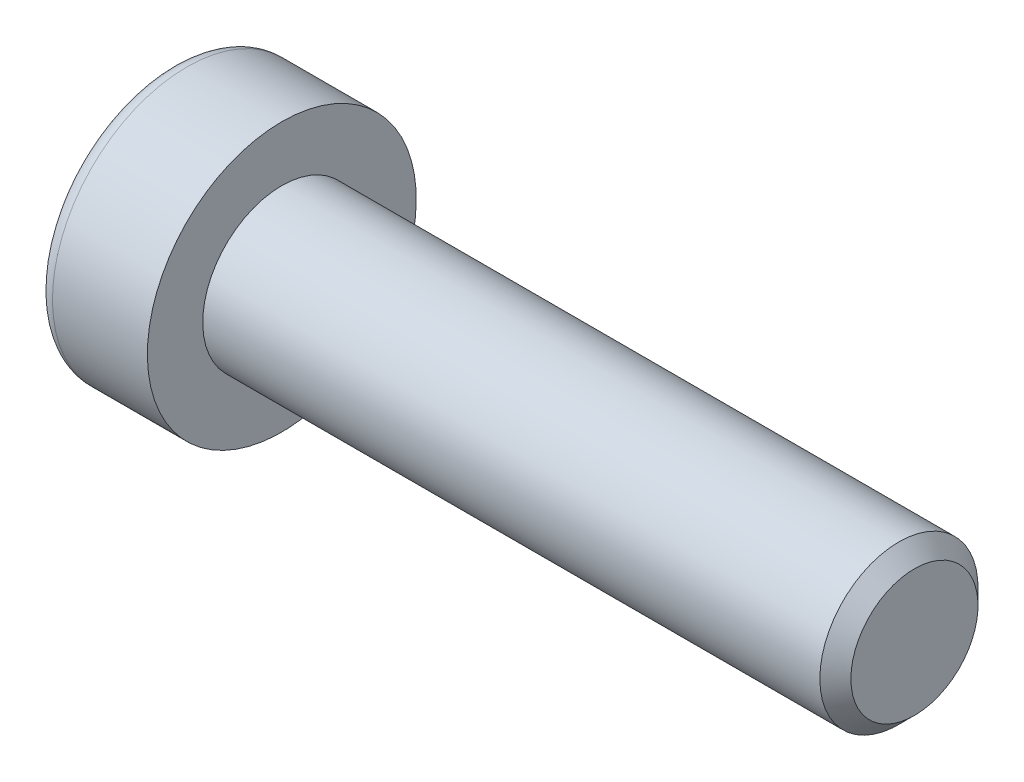
ISO-10303-21;
HEADER;
FILE_DESCRIPTION(('STEP AP214'),'2;1');
FILE_NAME('part.step','',(''),(''),'','','');
FILE_SCHEMA(('AUTOMOTIVE_DESIGN { 1 0 10303 214 1 1 1 1 }'));
ENDSEC;
DATA;
#1=APPLICATION_CONTEXT('core data for automotive mechanical design processes');
#2=APPLICATION_PROTOCOL_DEFINITION('international standard','automotive_design',2000,#1);
#3=PRODUCT_CONTEXT('',#1,'mechanical');
#4=PRODUCT('Part','Part','',(#3));
#5=PRODUCT_RELATED_PRODUCT_CATEGORY('part','',(#4));
#6=PRODUCT_DEFINITION_FORMATION('','',#4);
#7=PRODUCT_DEFINITION_CONTEXT('part definition',#1,'design');
#8=PRODUCT_DEFINITION('design','',#6,#7);
#9=PRODUCT_DEFINITION_SHAPE('','',#8);
#10=(LENGTH_UNIT() NAMED_UNIT(*) SI_UNIT(.MILLI.,.METRE.));
#11=(NAMED_UNIT(*) PLANE_ANGLE_UNIT() SI_UNIT($,.RADIAN.));
#12=(NAMED_UNIT(*) SI_UNIT($,.STERADIAN.) SOLID_ANGLE_UNIT());
#13=UNCERTAINTY_MEASURE_WITH_UNIT(LENGTH_MEASURE(1.E-05),#10,'distance_accuracy_value','');
#14=(GEOMETRIC_REPRESENTATION_CONTEXT(3) GLOBAL_UNCERTAINTY_ASSIGNED_CONTEXT((#13)) GLOBAL_UNIT_ASSIGNED_CONTEXT((#10,
#11,#12)) REPRESENTATION_CONTEXT('',''));
#15=CARTESIAN_POINT('',(0.,0.,0.));
#16=DIRECTION('',(0.,0.,1.));
#17=DIRECTION('',(1.,0.,0.));
#18=AXIS2_PLACEMENT_3D('',#15,#16,#17);
#19=CARTESIAN_POINT('',(-3.5,-1.5,0.866025403784439));
#20=DIRECTION('',(0.,-0.5,0.866025403784439));
#21=DIRECTION('',(0.,-0.866025403784439,-0.5));
#22=AXIS2_PLACEMENT_3D('',#19,#20,#21);
#23=PLANE('',#22);
#24=DIRECTION('',(1.,0.,0.));
#25=VECTOR('',#24,1.);
#26=CARTESIAN_POINT('',(-3.5,-1.5,0.866025403784438));
#27=LINE('',#26,#25);
#28=CARTESIAN_POINT('',(-0.799999988867068,-1.49999996233255,0.866025425531749));
#29=VERTEX_POINT('',#28);
#30=CARTESIAN_POINT('',(-3.5,-1.5,0.866025403784438));
#31=VERTEX_POINT('',#30);
#32=EDGE_CURVE('E77',#29,#31,#27,.F.);
#33=ORIENTED_EDGE('',*,*,#32,.T.);
#34=DIRECTION('',(0.,-0.866025403784439,-0.5));
#35=VECTOR('',#34,1.);
#36=CARTESIAN_POINT('',(-3.5,-1.5,0.866025403784439));
#37=LINE('',#36,#35);
#38=CARTESIAN_POINT('',(-3.5,0.,1.73205080756888));
#39=VERTEX_POINT('',#38);
#40=EDGE_CURVE('E89',#39,#31,#37,.T.);
#41=ORIENTED_EDGE('',*,*,#40,.F.);
#42=DIRECTION('',(1.,0.,0.));
#43=VECTOR('',#42,1.);
#44=CARTESIAN_POINT('',(-3.5,0.,1.73205080756888));
#45=LINE('',#44,#43);
#46=CARTESIAN_POINT('',(-0.799999997521485,1.17041970314799E-08,1.73205080081146));
#47=VERTEX_POINT('',#46);
#48=EDGE_CURVE('E72',#39,#47,#45,.T.);
#49=ORIENTED_EDGE('',*,*,#48,.T.);
#50=CARTESIAN_POINT('',(-0.800000004794053,-1.69571014172341E-08,1.73205077642877));
#51=CARTESIAN_POINT('',(-0.778021656696874,-0.0659159374438855,1.69399421567383));
#52=CARTESIAN_POINT('',(-0.758033503093598,-0.132400840652987,1.65560914452181));
#53=CARTESIAN_POINT('',(-0.723144784654454,-0.266521786306955,1.57817438455973));
#54=CARTESIAN_POINT('',(-0.708256560777632,-0.334160211038563,1.53912332031867));
#55=CARTESIAN_POINT('',(-0.685081966752258,-0.468598851907672,1.46150513374616));
#56=CARTESIAN_POINT('',(-0.67664133885179,-0.535378388716331,1.42294995058342));
#57=CARTESIAN_POINT('',(-0.666566875869104,-0.669251518013702,1.34565826362971));
#58=CARTESIAN_POINT('',(-0.664924696262234,-0.736344624244432,1.30692204058053));
#59=CARTESIAN_POINT('',(-0.668349720014557,-0.861700886716701,1.23454756863114));
#60=CARTESIAN_POINT('',(-0.672575966117477,-0.919982853711116,1.20089845932059));
#61=CARTESIAN_POINT('',(-0.685967975897171,-1.03616709970217,1.13381945363874));
#62=CARTESIAN_POINT('',(-0.695138309776003,-1.09406897714887,1.10038978910236));
#63=CARTESIAN_POINT('',(-0.718062369113586,-1.2104925736284,1.03317259433002));
#64=CARTESIAN_POINT('',(-0.731913222805025,-1.26899956512162,0.999393567043165));
#65=CARTESIAN_POINT('',(-0.763348804941712,-1.38514116892087,0.932339180828007));
#66=CARTESIAN_POINT('',(-0.780926152022884,-1.44277726798599,0.89906296351894));
#67=CARTESIAN_POINT('',(-0.799999976323267,-1.49999992470115,0.866025447258253));
#68=B_SPLINE_CURVE_WITH_KNOTS('',3,(#50,#51,#52,#53,#54,#55,#56,#57,#58,#59,#60,#61,#62,#63,#64,
#65,#66,#67),.UNSPECIFIED.,.F.,.F.,(4,2,2,2,2,2,2,2,4),(0.,0.237762010114539,0.476095365250291,
0.708530707823554,0.940680670783404,1.14278081101932,1.3450680891288,1.55184112920544,
1.75820836138337),.UNSPECIFIED.);
#69=EDGE_CURVE('E18',#47,#29,#68,.T.);
#70=ORIENTED_EDGE('',*,*,#69,.T.);
#71=EDGE_LOOP('',(#33,#41,#49,#70));
#72=FACE_BOUND('',#71,.T.);
#73=ADVANCED_FACE('F14',(#72),#23,.F.);
#74=CARTESIAN_POINT('',(-3.5,-1.5,-0.866025403784438));
#75=DIRECTION('',(0.,-1.,0.));
#76=DIRECTION('',(0.,0.,-1.));
#77=AXIS2_PLACEMENT_3D('',#74,#75,#76);
#78=PLANE('',#77);
#79=DIRECTION('',(1.,0.,0.));
#80=VECTOR('',#79,1.);
#81=CARTESIAN_POINT('',(-3.5,-1.5,-0.866025403784439));
#82=LINE('',#81,#80);
#83=CARTESIAN_POINT('',(-0.799999988871031,-1.5,-0.866025360303542));
#84=VERTEX_POINT('',#83);
#85=CARTESIAN_POINT('',(-3.5,-1.5,-0.866025403784438));
#86=VERTEX_POINT('',#85);
#87=EDGE_CURVE('E215',#84,#86,#82,.F.);
#88=ORIENTED_EDGE('',*,*,#87,.T.);
#89=DIRECTION('',(0.,0.,-1.));
#90=VECTOR('',#89,1.);
#91=CARTESIAN_POINT('',(-3.5,-1.5,-0.866025403784438));
#92=LINE('',#91,#90);
#93=EDGE_CURVE('E88',#31,#86,#92,.T.);
#94=ORIENTED_EDGE('',*,*,#93,.F.);
#95=ORIENTED_EDGE('',*,*,#32,.F.);
#96=CARTESIAN_POINT('',(-0.800000033434989,-1.49999996275919,0.866025430217359));
#97=CARTESIAN_POINT('',(-0.778021676301525,-1.49999998662477,0.789912288030923));
#98=CARTESIAN_POINT('',(-0.758033517947388,-1.49999999641521,0.71314213601303));
#99=CARTESIAN_POINT('',(-0.723144793881313,-1.5000000035934,0.558272606337249));
#100=CARTESIAN_POINT('',(-0.708256569131695,-1.50000000095129,0.480170477841771));
#101=CARTESIAN_POINT('',(-0.68508197255406,-1.49999999907226,0.324934102206935));
#102=CARTESIAN_POINT('',(-0.676641342974203,-1.49999999975269,0.247823733476011));
#103=CARTESIAN_POINT('',(-0.666566877161477,-1.500000000247,0.0932403552687408));
#104=CARTESIAN_POINT('',(-0.664924696406791,-1.50000000006194,0.01576790727506));
#105=CARTESIAN_POINT('',(-0.668349718342616,-1.49999999994608,-0.12898104146176));
#106=CARTESIAN_POINT('',(-0.672575963817816,-1.49999999998547,-0.196279262989629));
#107=CARTESIAN_POINT('',(-0.685967972836551,-1.50000000001455,-0.330437280109427));
#108=CARTESIAN_POINT('',(-0.695138306581063,-1.5000000000042,-0.397296612031607));
#109=CARTESIAN_POINT('',(-0.718062366109409,-1.49999999999571,-0.531731007513679));
#110=CARTESIAN_POINT('',(-0.731913220149705,-1.49999999999786,-0.599289065171955));
#111=CARTESIAN_POINT('',(-0.763348803360585,-1.50000000000214,-0.733397843717908));
#112=CARTESIAN_POINT('',(-0.780926151167941,-1.50000000000427,-0.799950281366898));
#113=CARTESIAN_POINT('',(-0.799999976331814,-1.5,-0.866025316866421));
#114=B_SPLINE_CURVE_WITH_KNOTS('',3,(#96,#97,#98,#99,#100,#101,#102,#103,#104,#105,#106,#107,
#108,#109,#110,#111,#112,#113),.UNSPECIFIED.,.F.,.F.,(4,2,2,2,2,2,2,2,4),(0.,0.237762017439527,
0.476095379639777,0.708530728272866,0.940680697404313,1.14278084610673,1.34506813262744,
1.55184118195675,1.75820842345583),.UNSPECIFIED.);
#115=EDGE_CURVE('E82',#29,#84,#114,.T.);
#116=ORIENTED_EDGE('',*,*,#115,.T.);
#117=EDGE_LOOP('',(#88,#94,#95,#116));
#118=FACE_BOUND('',#117,.T.);
#119=ADVANCED_FACE('F86',(#118),#78,.F.);
#120=CARTESIAN_POINT('',(-3.5,0.,1.73205080756888));
#121=DIRECTION('',(0.,0.500000000000001,0.866025403784438));
#122=DIRECTION('',(0.,-0.866025403784438,0.500000000000001));
#123=AXIS2_PLACEMENT_3D('',#120,#121,#122);
#124=PLANE('',#123);
#125=ORIENTED_EDGE('',*,*,#48,.F.);
#126=DIRECTION('',(0.,-0.866025403784438,0.500000000000001));
#127=VECTOR('',#126,1.);
#128=CARTESIAN_POINT('',(-3.5,0.,1.73205080756888));
#129=LINE('',#128,#127);
#130=CARTESIAN_POINT('',(-3.5,1.5,0.866025403784437));
#131=VERTEX_POINT('',#130);
#132=EDGE_CURVE('E218',#131,#39,#129,.T.);
#133=ORIENTED_EDGE('',*,*,#132,.F.);
#134=DIRECTION('',(1.,0.,0.));
#135=VECTOR('',#134,1.);
#136=CARTESIAN_POINT('',(-3.5,1.5,0.866025403784437));
#137=LINE('',#136,#135);
#138=CARTESIAN_POINT('',(-0.799999988867498,1.5,0.866025360291303));
#139=VERTEX_POINT('',#138);
#140=EDGE_CURVE('E83',#131,#139,#137,.T.);
#141=ORIENTED_EDGE('',*,*,#140,.T.);
#142=CARTESIAN_POINT('',(-0.800000033433567,1.50000000426921,0.8660253583187));
#143=CARTESIAN_POINT('',(-0.778021676295276,1.43408410149037,0.904081950088849));
#144=CARTESIAN_POINT('',(-0.758033517936987,1.36759920446941,0.942467034585691));
#145=CARTESIAN_POINT('',(-0.723144793864638,1.23347826105221,1.01990180566003));
#146=CARTESIAN_POINT('',(-0.708256569113062,1.16583983234576,1.05895286763048));
#147=CARTESIAN_POINT('',(-0.68508197254175,1.03140118651243,1.13657105382219));
#148=CARTESIAN_POINT('',(-0.676641342966919,0.96462164865295,1.1751262387674));
#149=CARTESIAN_POINT('',(-0.666566877160271,0.830748516405722,1.25241792827836));
#150=CARTESIAN_POINT('',(-0.664924696406481,0.763655408276764,1.29115415210369));
#151=CARTESIAN_POINT('',(-0.668349718457172,0.638299137294113,1.36352862876635));
#152=CARTESIAN_POINT('',(-0.67257596442367,0.580017163683088,1.39717774196506));
#153=CARTESIAN_POINT('',(-0.68596797510084,0.463832904503485,1.46425675531158));
#154=CARTESIAN_POINT('',(-0.695138310014093,0.40593102048483,1.49768642362438));
#155=CARTESIAN_POINT('',(-0.718062372456597,0.289507410578443,1.56490362613407));
#156=CARTESIAN_POINT('',(-0.73191322826342,0.231000412237723,1.59868265737804));
#157=CARTESIAN_POINT('',(-0.763348815391527,0.114858794941851,1.66573705139287));
#158=CARTESIAN_POINT('',(-0.780926165347246,0.0572226892272379,1.69901327254471));
#159=CARTESIAN_POINT('',(-0.799999992771162,2.59551646262387E-08,1.73205079258366));
#160=B_SPLINE_CURVE_WITH_KNOTS('',3,(#142,#143,#144,#145,#146,#147,#148,#149,#150,#151,#152,
#153,#154,#155,#156,#157,#158,#159),.UNSPECIFIED.,.F.,.F.,(4,2,2,2,2,2,2,2,4),(0.,
0.237762017496781,0.476095379761698,0.708530728335868,0.94068069740302,1.14278086052986,
1.34506816152837,1.55184122608726,1.75820848269998),.UNSPECIFIED.);
#161=EDGE_CURVE('E119',#139,#47,#160,.T.);
#162=ORIENTED_EDGE('',*,*,#161,.T.);
#163=EDGE_LOOP('',(#125,#133,#141,#162));
#164=FACE_BOUND('',#163,.T.);
#165=ADVANCED_FACE('F112',(#164),#124,.F.);
#166=CARTESIAN_POINT('',(-3.5,0.,-1.73205080756888));
#167=DIRECTION('',(0.,-0.5,-0.866025403784439));
#168=DIRECTION('',(0.,0.866025403784439,-0.5));
#169=AXIS2_PLACEMENT_3D('',#166,#167,#168);
#170=PLANE('',#169);
#171=DIRECTION('',(1.,0.,0.));
#172=VECTOR('',#171,1.);
#173=CARTESIAN_POINT('',(-3.5,0.,-1.73205080756888));
#174=LINE('',#173,#172);
#175=CARTESIAN_POINT('',(-0.799999993625576,-5.19317473647624E-08,-1.73205079406354));
#176=VERTEX_POINT('',#175);
#177=CARTESIAN_POINT('',(-3.5,0.,-1.73205080756888));
#178=VERTEX_POINT('',#177);
#179=EDGE_CURVE('E124',#176,#178,#174,.F.);
#180=ORIENTED_EDGE('',*,*,#179,.T.);
#181=DIRECTION('',(0.,0.866025403784439,-0.5));
#182=VECTOR('',#181,1.);
#183=CARTESIAN_POINT('',(-3.5,0.,-1.73205080756888));
#184=LINE('',#183,#182);
#185=EDGE_CURVE('E37',#86,#178,#184,.T.);
#186=ORIENTED_EDGE('',*,*,#185,.F.);
#187=ORIENTED_EDGE('',*,*,#87,.F.);
#188=CARTESIAN_POINT('',(-0.800000033429313,-1.5000000042963,-0.866025358321739));
#189=CARTESIAN_POINT('',(-0.778021676302421,-1.43408410152741,-0.904081950074176));
#190=CARTESIAN_POINT('',(-0.75803351795084,-1.3675992045205,-0.942467034557997));
#191=CARTESIAN_POINT('',(-0.723144793886204,-1.23347826113726,-1.01990180560912));
#192=CARTESIAN_POINT('',(-0.708256569135469,-1.16583983245078,-1.05895286756938));
#193=CARTESIAN_POINT('',(-0.685081972556364,-1.03140118662151,-1.13657105375968));
#194=CARTESIAN_POINT('',(-0.676641342976148,-0.964621648745721,-1.17512623871396));
#195=CARTESIAN_POINT('',(-0.666566877162353,-0.830748516463139,-1.25241792824509));
#196=CARTESIAN_POINT('',(-0.664924696406954,-0.763655408315126,-1.29115415208152));
#197=CARTESIAN_POINT('',(-0.668349718341486,-0.638299141479767,-1.36352862634979));
#198=CARTESIAN_POINT('',(-0.672575963816185,-0.580017172026168,-1.39717773714819));
#199=CARTESIAN_POINT('',(-0.685967972834059,-0.463832921092294,-1.46425674573402));
#200=CARTESIAN_POINT('',(-0.695138306578215,-0.405931041161778,-1.49768641168654));
#201=CARTESIAN_POINT('',(-0.718062366105987,-0.289507439526365,-1.56490360942098));
#202=CARTESIAN_POINT('',(-0.731913220146064,-0.23100044536442,-1.59868263825233));
#203=CARTESIAN_POINT('',(-0.763348803356627,-0.114858836274076,-1.6657370275297));
#204=CARTESIAN_POINT('',(-0.780926151163884,-0.0572227345867656,-1.69901324635637));
#205=CARTESIAN_POINT('',(-0.799999976327709,-7.52855253321485E-08,-1.73205076410276));
#206=B_SPLINE_CURVE_WITH_KNOTS('',3,(#188,#189,#190,#191,#192,#193,#194,#195,#196,#197,#198,
#199,#200,#201,#202,#203,#204,#205),.UNSPECIFIED.,.F.,.F.,(4,2,2,2,2,2,2,2,4),(0.,
0.237762017437609,0.476095379636302,0.708530728268337,0.940680697398584,1.14278084610309,
1.34506813262598,1.55184118195724,1.75820842345815),.UNSPECIFIED.);
#207=EDGE_CURVE('E95',#84,#176,#206,.T.);
#208=ORIENTED_EDGE('',*,*,#207,.T.);
#209=EDGE_LOOP('',(#180,#186,#187,#208));
#210=FACE_BOUND('',#209,.T.);
#211=ADVANCED_FACE('F115',(#210),#170,.F.);
#212=CARTESIAN_POINT('',(-3.5,1.5,0.866025403784437));
#213=DIRECTION('',(0.,1.,0.));
#214=DIRECTION('',(0.,0.,1.));
#215=AXIS2_PLACEMENT_3D('',#212,#213,#214);
#216=PLANE('',#215);
#217=ORIENTED_EDGE('',*,*,#140,.F.);
#218=DIRECTION('',(0.,0.,1.));
#219=VECTOR('',#218,1.);
#220=CARTESIAN_POINT('',(-3.5,1.5,0.866025403784437));
#221=LINE('',#220,#219);
#222=CARTESIAN_POINT('',(-3.5,1.5,-0.866025403784439));
#223=VERTEX_POINT('',#222);
#224=EDGE_CURVE('E211',#223,#131,#221,.T.);
#225=ORIENTED_EDGE('',*,*,#224,.F.);
#226=DIRECTION('',(1.,0.,0.));
#227=VECTOR('',#226,1.);
#228=CARTESIAN_POINT('',(-3.5,1.5,-0.866025403784439));
#229=LINE('',#228,#227);
#230=CARTESIAN_POINT('',(-0.800000001368559,1.5,-0.866025403596251));
#231=VERTEX_POINT('',#230);
#232=EDGE_CURVE('E202',#223,#231,#229,.T.);
#233=ORIENTED_EDGE('',*,*,#232,.T.);
#234=CARTESIAN_POINT('',(-0.800000001154136,1.50000000026491,-0.866025403454279));
#235=CARTESIAN_POINT('',(-0.778021660048943,1.50000000009515,-0.789912260141364));
#236=CARTESIAN_POINT('',(-0.758033509022436,1.5000000000255,-0.713142109270289));
#237=CARTESIAN_POINT('',(-0.723144791693316,1.49999999997444,-0.558272583727159));
#238=CARTESIAN_POINT('',(-0.708256566349069,1.49999999999323,-0.480170458219125));
#239=CARTESIAN_POINT('',(-0.685081970234259,1.5000000000066,-0.324934087631714));
#240=CARTESIAN_POINT('',(-0.676641341702514,1.50000000000176,-0.247823720966487));
#241=CARTESIAN_POINT('',(-0.666566877089259,1.49999999999824,-0.0932403471747105));
#242=CARTESIAN_POINT('',(-0.664924696478615,1.49999999999956,-0.015767901531159));
#243=CARTESIAN_POINT('',(-0.668349718474959,1.50000000000038,0.128981044687817));
#244=CARTESIAN_POINT('',(-0.672575964042955,1.5000000000001,0.196279266039076));
#245=CARTESIAN_POINT('',(-0.685967973189808,1.4999999999999,0.330437282853159));
#246=CARTESIAN_POINT('',(-0.695138306973846,1.49999999999997,0.397296614645791));
#247=CARTESIAN_POINT('',(-0.71806236652139,1.50000000000003,0.531731009611409));
#248=CARTESIAN_POINT('',(-0.731913220523855,1.50000000000002,0.599289066885838));
#249=CARTESIAN_POINT('',(-0.763348803593243,1.49999999999999,0.733397844592943));
#250=CARTESIAN_POINT('',(-0.780926151292484,1.49999999999997,0.799950281787972));
#251=CARTESIAN_POINT('',(-0.799999976324083,1.5,0.866025316839637));
#252=B_SPLINE_CURVE_WITH_KNOTS('',3,(#234,#235,#236,#237,#238,#239,#240,#241,#242,#243,#244,
#245,#246,#247,#248,#249,#250,#251),.UNSPECIFIED.,.F.,.F.,(4,2,2,2,2,2,2,2,4),(0.,
0.237762008631603,0.476095362696117,0.708530704661828,0.940680666845777,1.14278081501453,
1.34506810117545,1.5518411493544,1.75820838945523),.UNSPECIFIED.);
#253=EDGE_CURVE('E96',#231,#139,#252,.T.);
#254=ORIENTED_EDGE('',*,*,#253,.T.);
#255=EDGE_LOOP('',(#217,#225,#233,#254));
#256=FACE_BOUND('',#255,.T.);
#257=ADVANCED_FACE('F134',(#256),#216,.F.);
#258=CARTESIAN_POINT('',(-0.80600000103459,0.,0.));
#259=DIRECTION('',(-1.,0.,0.));
#260=DIRECTION('',(0.,0.,1.));
#261=AXIS2_PLACEMENT_3D('',#258,#259,#260);
#262=CONICAL_SURFACE('',#261,1.74244311170924,1.04719754984197);
#263=CARTESIAN_POINT('',(0.200000001427725,-1.13686837721616E-10,0.));
#264=VERTEX_POINT('',#263);
#265=VERTEX_LOOP('',#264);
#266=FACE_BOUND('',#265,.T.);
#267=ORIENTED_EDGE('',*,*,#253,.F.);
#268=CARTESIAN_POINT('',(-0.800000001154134,1.49999999984653,-0.866025404178943));
#269=CARTESIAN_POINT('',(-0.778021660038383,1.4340840840587,-0.904081975706894));
#270=CARTESIAN_POINT('',(-0.758033509003093,1.36759918308469,-0.942467051100864));
#271=CARTESIAN_POINT('',(-0.723144791660858,1.23347823959674,-1.01990181386864));
#272=CARTESIAN_POINT('',(-0.708256566312607,1.165839814789,-1.05895287666065));
#273=CARTESIAN_POINT('',(-0.685081970210198,1.03140117427002,-1.1365710619692));
#274=CARTESIAN_POINT('',(-0.676641341688346,0.964621637873208,-1.17512624527867));
#275=CARTESIAN_POINT('',(-0.666566877086974,0.83074850923666,-1.25241793213018));
#276=CARTESIAN_POINT('',(-0.664924696478011,0.763655403255479,-1.29115415493071));
#277=CARTESIAN_POINT('',(-0.668349718704072,0.638299130357656,-1.36352863283382));
#278=CARTESIAN_POINT('',(-0.672575965255319,0.580017152715343,-1.39717774831419));
#279=CARTESIAN_POINT('',(-0.685967977721396,0.463832885526248,-1.46425676625118));
#280=CARTESIAN_POINT('',(-0.695138313844609,0.405930997529957,-1.49768643687251));
#281=CARTESIAN_POINT('',(-0.718062379224753,0.289507379790228,-1.56490364391464));
#282=CARTESIAN_POINT('',(-0.731913236762889,0.23100037759508,-1.59868267738147));
#283=CARTESIAN_POINT('',(-0.763348827672567,0.114858752804272,-1.66573707571853));
#284=CARTESIAN_POINT('',(-0.780926179671749,0.0572226434477013,-1.69901329897057));
#285=CARTESIAN_POINT('',(-0.800000009226824,-2.34118217365936E-08,-1.7320508210857));
#286=B_SPLINE_CURVE_WITH_KNOTS('',3,(#268,#269,#270,#271,#272,#273,#274,#275,#276,#277,#278,
#279,#280,#281,#282,#283,#284,#285),.UNSPECIFIED.,.F.,.F.,(4,2,2,2,2,2,2,2,4),(0.,
0.237762008746921,0.476095362941565,0.708530704789954,0.940680666845832,1.14278084388537,
1.34506815902389,1.55184123768522,1.75820850803633),.UNSPECIFIED.);
#287=EDGE_CURVE('E125',#231,#176,#286,.T.);
#288=ORIENTED_EDGE('',*,*,#287,.T.);
#289=ORIENTED_EDGE('',*,*,#207,.F.);
#290=ORIENTED_EDGE('',*,*,#115,.F.);
#291=ORIENTED_EDGE('',*,*,#69,.F.);
#292=ORIENTED_EDGE('',*,*,#161,.F.);
#293=EDGE_LOOP('',(#267,#288,#289,#290,#291,#292));
#294=FACE_BOUND('',#293,.T.);
#295=ADVANCED_FACE('F93',(#266,#294),#262,.F.);
#296=CARTESIAN_POINT('',(-3.5,1.5,-0.866025403784439));
#297=DIRECTION('',(0.,0.5,-0.866025403784439));
#298=DIRECTION('',(0.,0.866025403784439,0.5));
#299=AXIS2_PLACEMENT_3D('',#296,#297,#298);
#300=PLANE('',#299);
#301=ORIENTED_EDGE('',*,*,#232,.F.);
#302=DIRECTION('',(0.,0.866025403784439,0.5));
#303=VECTOR('',#302,1.);
#304=CARTESIAN_POINT('',(-3.5,0.,-1.73205080756888));
#305=LINE('',#304,#303);
#306=EDGE_CURVE('E213',#178,#223,#305,.T.);
#307=ORIENTED_EDGE('',*,*,#306,.F.);
#308=ORIENTED_EDGE('',*,*,#179,.F.);
#309=ORIENTED_EDGE('',*,*,#287,.F.);
#310=EDGE_LOOP('',(#301,#307,#308,#309));
#311=FACE_BOUND('',#310,.T.);
#312=ADVANCED_FACE('F143',(#311),#300,.F.);
#313=CARTESIAN_POINT('',(-3.5,2.99102540378444,0.));
#314=DIRECTION('',(-1.,0.,0.));
#315=DIRECTION('',(0.,0.,1.));
#316=AXIS2_PLACEMENT_3D('',#313,#314,#315);
#317=PLANE('',#316);
#318=ORIENTED_EDGE('',*,*,#185,.T.);
#319=ORIENTED_EDGE('',*,*,#306,.T.);
#320=ORIENTED_EDGE('',*,*,#224,.T.);
#321=ORIENTED_EDGE('',*,*,#132,.T.);
#322=ORIENTED_EDGE('',*,*,#40,.T.);
#323=ORIENTED_EDGE('',*,*,#93,.T.);
#324=EDGE_LOOP('',(#318,#319,#320,#321,#322,#323));
#325=FACE_BOUND('',#324,.T.);
#326=CARTESIAN_POINT('',(-3.5,0.,0.));
#327=DIRECTION('',(1.,0.,0.));
#328=DIRECTION('',(0.,1.,0.));
#329=AXIS2_PLACEMENT_3D('',#326,#327,#328);
#330=CIRCLE('',#329,3.75);
#331=CARTESIAN_POINT('',(-3.5,3.75,0.));
#332=VERTEX_POINT('',#331);
#333=EDGE_CURVE('E189',#332,#332,#330,.T.);
#334=ORIENTED_EDGE('',*,*,#333,.F.);
#335=EDGE_LOOP('',(#334));
#336=FACE_BOUND('',#335,.T.);
#337=ADVANCED_FACE('F176',(#325,#336),#317,.T.);
#338=CARTESIAN_POINT('',(-3.,0.,0.));
#339=DIRECTION('',(1.,0.,0.));
#340=DIRECTION('',(0.,0.,-1.));
#341=AXIS2_PLACEMENT_3D('',#338,#339,#340);
#342=TOROIDAL_SURFACE('',#341,3.75,0.5);
#343=CARTESIAN_POINT('',(-3.,0.,0.));
#344=DIRECTION('',(1.,0.,0.));
#345=DIRECTION('',(0.,1.,0.));
#346=AXIS2_PLACEMENT_3D('',#343,#344,#345);
#347=CIRCLE('',#346,4.25);
#348=CARTESIAN_POINT('',(-3.,4.25,0.));
#349=VERTEX_POINT('',#348);
#350=EDGE_CURVE('E229',#349,#349,#347,.T.);
#351=ORIENTED_EDGE('',*,*,#350,.F.);
#352=EDGE_LOOP('',(#351));
#353=FACE_BOUND('',#352,.T.);
#354=ORIENTED_EDGE('',*,*,#333,.T.);
#355=EDGE_LOOP('',(#354));
#356=FACE_BOUND('',#355,.T.);
#357=ADVANCED_FACE('F170',(#353,#356),#342,.T.);
#358=CARTESIAN_POINT('',(-1.75,0.,0.));
#359=DIRECTION('',(1.,0.,0.));
#360=DIRECTION('',(0.,1.,0.));
#361=AXIS2_PLACEMENT_3D('',#358,#359,#360);
#362=CYLINDRICAL_SURFACE('',#361,4.25);
#363=ORIENTED_EDGE('',*,*,#350,.T.);
#364=EDGE_LOOP('',(#363));
#365=FACE_BOUND('',#364,.T.);
#366=CARTESIAN_POINT('',(0.,0.,0.));
#367=DIRECTION('',(1.,0.,0.));
#368=DIRECTION('',(0.,1.,0.));
#369=AXIS2_PLACEMENT_3D('',#366,#367,#368);
#370=CIRCLE('',#369,4.25);
#371=CARTESIAN_POINT('',(0.,4.25,0.));
#372=VERTEX_POINT('',#371);
#373=EDGE_CURVE('E227',#372,#372,#370,.T.);
#374=ORIENTED_EDGE('',*,*,#373,.F.);
#375=EDGE_LOOP('',(#374));
#376=FACE_BOUND('',#375,.T.);
#377=ADVANCED_FACE('F166',(#365,#376),#362,.T.);
#378=CARTESIAN_POINT('',(20.,1.25,0.));
#379=DIRECTION('',(1.,0.,0.));
#380=DIRECTION('',(0.,0.,-1.));
#381=AXIS2_PLACEMENT_3D('',#378,#379,#380);
#382=PLANE('',#381);
#383=CARTESIAN_POINT('',(20.0000000002092,0.,0.));
#384=DIRECTION('',(-1.,0.,0.));
#385=DIRECTION('',(0.,0.,1.));
#386=AXIS2_PLACEMENT_3D('',#383,#384,#385);
#387=CIRCLE('',#386,2.00924000017721);
#388=CARTESIAN_POINT('',(20.0000000002092,0.,2.00924000017721));
#389=VERTEX_POINT('',#388);
#390=EDGE_CURVE('E225',#389,#389,#387,.T.);
#391=ORIENTED_EDGE('',*,*,#390,.F.);
#392=EDGE_LOOP('',(#391));
#393=FACE_BOUND('',#392,.T.);
#394=ADVANCED_FACE('F162',(#393),#382,.T.);
#395=CARTESIAN_POINT('',(0.,3.375,0.));
#396=DIRECTION('',(1.,0.,0.));
#397=DIRECTION('',(0.,0.,-1.));
#398=AXIS2_PLACEMENT_3D('',#395,#396,#397);
#399=PLANE('',#398);
#400=CARTESIAN_POINT('',(0.,0.,0.));
#401=DIRECTION('',(1.,0.,0.));
#402=DIRECTION('',(0.,1.,0.));
#403=AXIS2_PLACEMENT_3D('',#400,#401,#402);
#404=CIRCLE('',#403,2.5);
#405=CARTESIAN_POINT('',(0.,2.5,0.));
#406=VERTEX_POINT('',#405);
#407=EDGE_CURVE('E28',#406,#406,#404,.T.);
#408=ORIENTED_EDGE('',*,*,#407,.F.);
#409=EDGE_LOOP('',(#408));
#410=FACE_BOUND('',#409,.T.);
#411=ORIENTED_EDGE('',*,*,#373,.T.);
#412=EDGE_LOOP('',(#411));
#413=FACE_BOUND('',#412,.T.);
#414=ADVANCED_FACE('F155',(#410,#413),#399,.T.);
#415=CARTESIAN_POINT('',(19.5092399998202,0.,0.));
#416=DIRECTION('',(-1.,0.,0.));
#417=DIRECTION('',(0.,0.,1.));
#418=AXIS2_PLACEMENT_3D('',#415,#416,#417);
#419=CONICAL_SURFACE('',#418,2.49999999971351,0.785398162528743);
#420=ORIENTED_EDGE('',*,*,#390,.T.);
#421=EDGE_LOOP('',(#420));
#422=FACE_BOUND('',#421,.T.);
#423=CARTESIAN_POINT('',(19.50924,0.,0.));
#424=DIRECTION('',(1.,0.,0.));
#425=DIRECTION('',(0.,1.,0.));
#426=AXIS2_PLACEMENT_3D('',#423,#424,#425);
#427=CIRCLE('',#426,2.5);
#428=CARTESIAN_POINT('',(19.50924,2.5,0.));
#429=VERTEX_POINT('',#428);
#430=EDGE_CURVE('E9',#429,#429,#427,.F.);
#431=ORIENTED_EDGE('',*,*,#430,.F.);
#432=EDGE_LOOP('',(#431));
#433=FACE_BOUND('',#432,.T.);
#434=ADVANCED_FACE('F149',(#422,#433),#419,.T.);
#435=CARTESIAN_POINT('',(11.2,0.,0.));
#436=DIRECTION('',(1.,0.,0.));
#437=DIRECTION('',(0.,1.,0.));
#438=AXIS2_PLACEMENT_3D('',#435,#436,#437);
#439=CYLINDRICAL_SURFACE('',#438,2.5);
#440=ORIENTED_EDGE('',*,*,#430,.T.);
#441=EDGE_LOOP('',(#440));
#442=FACE_BOUND('',#441,.T.);
#443=ORIENTED_EDGE('',*,*,#407,.T.);
#444=EDGE_LOOP('',(#443));
#445=FACE_BOUND('',#444,.T.);
#446=ADVANCED_FACE('F147',(#442,#445),#439,.T.);
#447=CLOSED_SHELL('',(#73,#119,#165,#211,#257,#295,#312,#337,#357,#377,#394,#414,#434,#446));
#448=MANIFOLD_SOLID_BREP('B1',#447);
#449=ADVANCED_BREP_SHAPE_REPRESENTATION('',(#18,#448),#14);
#450=SHAPE_DEFINITION_REPRESENTATION(#9,#449);
ENDSEC;
END-ISO-10303-21;
